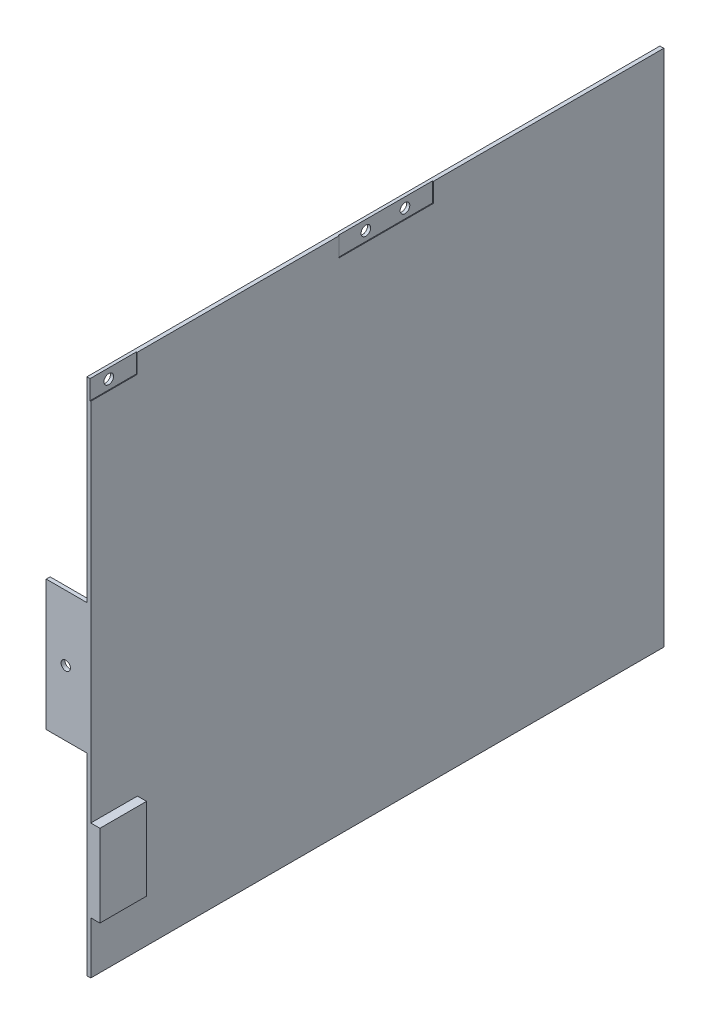
ISO-10303-21;
HEADER;
FILE_DESCRIPTION(('STEP AP214'),'2;1');
FILE_NAME('part.step','',(''),(''),'','','');
FILE_SCHEMA(('AUTOMOTIVE_DESIGN { 1 0 10303 214 1 1 1 1 }'));
ENDSEC;
DATA;
#1=APPLICATION_CONTEXT('core data for automotive mechanical design processes');
#2=APPLICATION_PROTOCOL_DEFINITION('international standard','automotive_design',2000,#1);
#3=PRODUCT_CONTEXT('',#1,'mechanical');
#4=PRODUCT('Part','Part','',(#3));
#5=PRODUCT_RELATED_PRODUCT_CATEGORY('part','',(#4));
#6=PRODUCT_DEFINITION_FORMATION('','',#4);
#7=PRODUCT_DEFINITION_CONTEXT('part definition',#1,'design');
#8=PRODUCT_DEFINITION('design','',#6,#7);
#9=PRODUCT_DEFINITION_SHAPE('','',#8);
#10=(LENGTH_UNIT() NAMED_UNIT(*) SI_UNIT(.MILLI.,.METRE.));
#11=(NAMED_UNIT(*) PLANE_ANGLE_UNIT() SI_UNIT($,.RADIAN.));
#12=(NAMED_UNIT(*) SI_UNIT($,.STERADIAN.) SOLID_ANGLE_UNIT());
#13=UNCERTAINTY_MEASURE_WITH_UNIT(LENGTH_MEASURE(1.E-05),#10,'distance_accuracy_value','');
#14=(GEOMETRIC_REPRESENTATION_CONTEXT(3) GLOBAL_UNCERTAINTY_ASSIGNED_CONTEXT((#13)) GLOBAL_UNIT_ASSIGNED_CONTEXT((#10,
#11,#12)) REPRESENTATION_CONTEXT('',''));
#15=CARTESIAN_POINT('',(0.,0.,0.));
#16=DIRECTION('',(0.,0.,1.));
#17=DIRECTION('',(1.,0.,0.));
#18=AXIS2_PLACEMENT_3D('',#15,#16,#17);
#19=CARTESIAN_POINT('',(163.5,-79.,-107.55));
#20=DIRECTION('',(0.,0.,1.));
#21=DIRECTION('',(1.,0.,0.));
#22=AXIS2_PLACEMENT_3D('',#19,#20,#21);
#23=PLANE('',#22);
#24=DIRECTION('',(0.,1.,0.));
#25=VECTOR('',#24,1.);
#26=CARTESIAN_POINT('',(162.,-79.,-107.55));
#27=LINE('',#26,#25);
#28=CARTESIAN_POINT('',(162.,-79.,-107.55));
#29=VERTEX_POINT('',#28);
#30=CARTESIAN_POINT('',(162.,-49.,-107.55));
#31=VERTEX_POINT('',#30);
#32=EDGE_CURVE('E234',#29,#31,#27,.T.);
#33=ORIENTED_EDGE('',*,*,#32,.F.);
#34=DIRECTION('',(-1.,0.,0.));
#35=VECTOR('',#34,1.);
#36=CARTESIAN_POINT('',(163.5,-79.,-107.55));
#37=LINE('',#36,#35);
#38=CARTESIAN_POINT('',(160.,-79.,-107.55));
#39=VERTEX_POINT('',#38);
#40=EDGE_CURVE('E50',#29,#39,#37,.T.);
#41=ORIENTED_EDGE('',*,*,#40,.T.);
#42=DIRECTION('',(0.,1.,0.));
#43=VECTOR('',#42,1.);
#44=CARTESIAN_POINT('',(160.,-79.,-107.55));
#45=LINE('',#44,#43);
#46=CARTESIAN_POINT('',(160.,-49.,-107.55));
#47=VERTEX_POINT('',#46);
#48=EDGE_CURVE('E236',#39,#47,#45,.T.);
#49=ORIENTED_EDGE('',*,*,#48,.T.);
#50=DIRECTION('',(-1.,0.,0.));
#51=VECTOR('',#50,1.);
#52=CARTESIAN_POINT('',(163.5,-49.,-107.55));
#53=LINE('',#52,#51);
#54=EDGE_CURVE('E276',#31,#47,#53,.T.);
#55=ORIENTED_EDGE('',*,*,#54,.F.);
#56=EDGE_LOOP('',(#33,#41,#49,#55));
#57=FACE_BOUND('',#56,.T.);
#58=ADVANCED_FACE('F35',(#57),#23,.F.);
#59=CARTESIAN_POINT('',(163.5,-49.,-122.45));
#60=DIRECTION('',(0.,1.,0.));
#61=DIRECTION('',(0.,0.,1.));
#62=AXIS2_PLACEMENT_3D('',#59,#60,#61);
#63=PLANE('',#62);
#64=DIRECTION('',(0.,0.,-1.));
#65=VECTOR('',#64,1.);
#66=CARTESIAN_POINT('',(162.,-49.,-122.45));
#67=LINE('',#66,#65);
#68=CARTESIAN_POINT('',(162.,-49.,-122.45));
#69=VERTEX_POINT('',#68);
#70=EDGE_CURVE('E232',#31,#69,#67,.T.);
#71=ORIENTED_EDGE('',*,*,#70,.F.);
#72=ORIENTED_EDGE('',*,*,#54,.T.);
#73=DIRECTION('',(0.,0.,-1.));
#74=VECTOR('',#73,1.);
#75=CARTESIAN_POINT('',(160.,-49.,-122.45));
#76=LINE('',#75,#74);
#77=CARTESIAN_POINT('',(160.,-49.,-122.45));
#78=VERTEX_POINT('',#77);
#79=EDGE_CURVE('E248',#47,#78,#76,.T.);
#80=ORIENTED_EDGE('',*,*,#79,.T.);
#81=DIRECTION('',(-1.,0.,0.));
#82=VECTOR('',#81,1.);
#83=CARTESIAN_POINT('',(163.5,-49.,-122.45));
#84=LINE('',#83,#82);
#85=EDGE_CURVE('E274',#69,#78,#84,.T.);
#86=ORIENTED_EDGE('',*,*,#85,.F.);
#87=EDGE_LOOP('',(#71,#72,#80,#86));
#88=FACE_BOUND('',#87,.T.);
#89=ADVANCED_FACE('F450',(#88),#63,.F.);
#90=CARTESIAN_POINT('',(163.5,-79.,-122.45));
#91=DIRECTION('',(0.,0.,-1.));
#92=DIRECTION('',(-1.,0.,0.));
#93=AXIS2_PLACEMENT_3D('',#90,#91,#92);
#94=PLANE('',#93);
#95=DIRECTION('',(0.,-1.,0.));
#96=VECTOR('',#95,1.);
#97=CARTESIAN_POINT('',(162.,-79.,-122.45));
#98=LINE('',#97,#96);
#99=CARTESIAN_POINT('',(162.,-79.,-122.45));
#100=VERTEX_POINT('',#99);
#101=EDGE_CURVE('E230',#69,#100,#98,.T.);
#102=ORIENTED_EDGE('',*,*,#101,.F.);
#103=ORIENTED_EDGE('',*,*,#85,.T.);
#104=DIRECTION('',(0.,-1.,0.));
#105=VECTOR('',#104,1.);
#106=CARTESIAN_POINT('',(160.,-79.,-122.45));
#107=LINE('',#106,#105);
#108=CARTESIAN_POINT('',(160.,-79.,-122.45));
#109=VERTEX_POINT('',#108);
#110=EDGE_CURVE('E251',#78,#109,#107,.T.);
#111=ORIENTED_EDGE('',*,*,#110,.T.);
#112=DIRECTION('',(-1.,0.,0.));
#113=VECTOR('',#112,1.);
#114=CARTESIAN_POINT('',(163.5,-79.,-122.45));
#115=LINE('',#114,#113);
#116=EDGE_CURVE('E272',#100,#109,#115,.T.);
#117=ORIENTED_EDGE('',*,*,#116,.F.);
#118=EDGE_LOOP('',(#102,#103,#111,#117));
#119=FACE_BOUND('',#118,.T.);
#120=ADVANCED_FACE('F455',(#119),#94,.F.);
#121=CARTESIAN_POINT('',(160.,100.,-291.));
#122=DIRECTION('',(-1.,0.,0.));
#123=DIRECTION('',(0.,0.,1.));
#124=AXIS2_PLACEMENT_3D('',#121,#122,#123);
#125=PLANE('',#124);
#126=DIRECTION('',(0.,0.,-1.));
#127=VECTOR('',#126,1.);
#128=CARTESIAN_POINT('',(160.,-79.,-107.55));
#129=LINE('',#128,#127);
#130=CARTESIAN_POINT('',(160.,-79.,-106.05));
#131=VERTEX_POINT('',#130);
#132=EDGE_CURVE('E240',#131,#39,#129,.T.);
#133=ORIENTED_EDGE('',*,*,#132,.F.);
#134=DIRECTION('',(0.,-1.,0.));
#135=VECTOR('',#134,1.);
#136=CARTESIAN_POINT('',(160.,100.,-106.05));
#137=LINE('',#136,#135);
#138=CARTESIAN_POINT('',(160.,-99.,-106.05));
#139=VERTEX_POINT('',#138);
#140=EDGE_CURVE('E200',#131,#139,#137,.T.);
#141=ORIENTED_EDGE('',*,*,#140,.T.);
#142=DIRECTION('',(0.,0.,-1.));
#143=VECTOR('',#142,1.);
#144=CARTESIAN_POINT('',(160.,-99.,81.202775637732));
#145=LINE('',#144,#143);
#146=CARTESIAN_POINT('',(160.,-99.,-325.9));
#147=VERTEX_POINT('',#146);
#148=EDGE_CURVE('E194',#139,#147,#145,.T.);
#149=ORIENTED_EDGE('',*,*,#148,.T.);
#150=DIRECTION('',(0.,1.,0.));
#151=VECTOR('',#150,1.);
#152=CARTESIAN_POINT('',(160.,100.,-325.9));
#153=LINE('',#152,#151);
#154=CARTESIAN_POINT('',(160.,100.,-325.9));
#155=VERTEX_POINT('',#154);
#156=EDGE_CURVE('E198',#147,#155,#153,.T.);
#157=ORIENTED_EDGE('',*,*,#156,.T.);
#158=DIRECTION('',(0.,0.,1.));
#159=VECTOR('',#158,1.);
#160=CARTESIAN_POINT('',(160.,100.,-291.));
#161=LINE('',#160,#159);
#162=CARTESIAN_POINT('',(160.,100.,-237.45));
#163=VERTEX_POINT('',#162);
#164=EDGE_CURVE('E361',#155,#163,#161,.T.);
#165=ORIENTED_EDGE('',*,*,#164,.T.);
#166=DIRECTION('',(0.,1.,0.));
#167=VECTOR('',#166,1.);
#168=CARTESIAN_POINT('',(160.,108.85,-237.45));
#169=LINE('',#168,#167);
#170=CARTESIAN_POINT('',(160.,92.65,-237.45));
#171=VERTEX_POINT('',#170);
#172=EDGE_CURVE('E282',#171,#163,#169,.T.);
#173=ORIENTED_EDGE('',*,*,#172,.F.);
#174=DIRECTION('',(0.,0.,-1.));
#175=VECTOR('',#174,1.);
#176=CARTESIAN_POINT('',(160.,92.65,-201.35));
#177=LINE('',#176,#175);
#178=CARTESIAN_POINT('',(160.,92.65,-201.35));
#179=VERTEX_POINT('',#178);
#180=EDGE_CURVE('E290',#179,#171,#177,.T.);
#181=ORIENTED_EDGE('',*,*,#180,.F.);
#182=DIRECTION('',(0.,-1.,0.));
#183=VECTOR('',#182,1.);
#184=CARTESIAN_POINT('',(160.,108.85,-201.35));
#185=LINE('',#184,#183);
#186=CARTESIAN_POINT('',(160.,100.,-201.35));
#187=VERTEX_POINT('',#186);
#188=EDGE_CURVE('E288',#187,#179,#185,.T.);
#189=ORIENTED_EDGE('',*,*,#188,.F.);
#190=CARTESIAN_POINT('',(160.,100.,-123.8));
#191=VERTEX_POINT('',#190);
#192=EDGE_CURVE('E360',#187,#191,#161,.T.);
#193=ORIENTED_EDGE('',*,*,#192,.T.);
#194=DIRECTION('',(0.,1.,0.));
#195=VECTOR('',#194,1.);
#196=CARTESIAN_POINT('',(160.,108.85,-123.8));
#197=LINE('',#196,#195);
#198=CARTESIAN_POINT('',(160.,92.65,-123.8));
#199=VERTEX_POINT('',#198);
#200=EDGE_CURVE('E203',#199,#191,#197,.T.);
#201=ORIENTED_EDGE('',*,*,#200,.F.);
#202=DIRECTION('',(0.,0.,-1.));
#203=VECTOR('',#202,1.);
#204=CARTESIAN_POINT('',(160.,92.65,-123.8));
#205=LINE('',#204,#203);
#206=CARTESIAN_POINT('',(160.,92.65,-106.05));
#207=VERTEX_POINT('',#206);
#208=EDGE_CURVE('E304',#207,#199,#205,.T.);
#209=ORIENTED_EDGE('',*,*,#208,.F.);
#210=CARTESIAN_POINT('',(160.,-47.5,-106.05));
#211=VERTEX_POINT('',#210);
#212=EDGE_CURVE('E351',#207,#211,#137,.T.);
#213=ORIENTED_EDGE('',*,*,#212,.T.);
#214=DIRECTION('',(0.,0.,1.));
#215=VECTOR('',#214,1.);
#216=CARTESIAN_POINT('',(160.,-47.5,-123.95));
#217=LINE('',#216,#215);
#218=CARTESIAN_POINT('',(160.,-47.5,-123.95));
#219=VERTEX_POINT('',#218);
#220=EDGE_CURVE('E260',#219,#211,#217,.T.);
#221=ORIENTED_EDGE('',*,*,#220,.F.);
#222=DIRECTION('',(0.,1.,0.));
#223=VECTOR('',#222,1.);
#224=CARTESIAN_POINT('',(160.,-79.,-123.95));
#225=LINE('',#224,#223);
#226=CARTESIAN_POINT('',(160.,-79.,-123.95));
#227=VERTEX_POINT('',#226);
#228=EDGE_CURVE('E257',#227,#219,#225,.T.);
#229=ORIENTED_EDGE('',*,*,#228,.F.);
#230=DIRECTION('',(0.,0.,-1.));
#231=VECTOR('',#230,1.);
#232=CARTESIAN_POINT('',(160.,-79.,-123.95));
#233=LINE('',#232,#231);
#234=EDGE_CURVE('E254',#109,#227,#233,.T.);
#235=ORIENTED_EDGE('',*,*,#234,.F.);
#236=ORIENTED_EDGE('',*,*,#110,.F.);
#237=ORIENTED_EDGE('',*,*,#79,.F.);
#238=ORIENTED_EDGE('',*,*,#48,.F.);
#239=EDGE_LOOP('',(#133,#141,#149,#157,#165,#173,#181,#189,#193,#201,#209,#213,#221,#229,#235,
#236,#237,#238));
#240=FACE_BOUND('',#239,.T.);
#241=ADVANCED_FACE('F37',(#240),#125,.F.);
#242=CARTESIAN_POINT('',(155.,96.25,-211.9));
#243=DIRECTION('',(1.,0.,0.));
#244=DIRECTION('',(0.,0.,-1.));
#245=AXIS2_PLACEMENT_3D('',#242,#243,#244);
#246=CYLINDRICAL_SURFACE('',#245,1.85);
#247=CARTESIAN_POINT('',(158.5,96.25,-211.9));
#248=DIRECTION('',(1.,0.,0.));
#249=DIRECTION('',(0.,0.,-1.));
#250=AXIS2_PLACEMENT_3D('',#247,#248,#249);
#251=CIRCLE('',#250,1.85);
#252=CARTESIAN_POINT('',(158.5,96.25,-213.75));
#253=VERTEX_POINT('',#252);
#254=EDGE_CURVE('E372',#253,#253,#251,.T.);
#255=ORIENTED_EDGE('',*,*,#254,.F.);
#256=EDGE_LOOP('',(#255));
#257=FACE_BOUND('',#256,.T.);
#258=CARTESIAN_POINT('',(159.7,96.25,-211.9));
#259=DIRECTION('',(1.,0.,0.));
#260=DIRECTION('',(0.,0.,-1.));
#261=AXIS2_PLACEMENT_3D('',#258,#259,#260);
#262=CIRCLE('',#261,1.85);
#263=CARTESIAN_POINT('',(159.7,96.25,-213.75));
#264=VERTEX_POINT('',#263);
#265=EDGE_CURVE('E310',#264,#264,#262,.F.);
#266=ORIENTED_EDGE('',*,*,#265,.F.);
#267=EDGE_LOOP('',(#266));
#268=FACE_BOUND('',#267,.T.);
#269=ADVANCED_FACE('F488',(#257,#268),#246,.F.);
#270=CARTESIAN_POINT('',(155.,96.25,-226.9));
#271=DIRECTION('',(1.,0.,0.));
#272=DIRECTION('',(0.,0.,-1.));
#273=AXIS2_PLACEMENT_3D('',#270,#271,#272);
#274=CYLINDRICAL_SURFACE('',#273,1.85);
#275=CARTESIAN_POINT('',(158.5,96.25,-226.9));
#276=DIRECTION('',(1.,0.,0.));
#277=DIRECTION('',(0.,0.,-1.));
#278=AXIS2_PLACEMENT_3D('',#275,#276,#277);
#279=CIRCLE('',#278,1.85);
#280=CARTESIAN_POINT('',(158.5,96.25,-228.75));
#281=VERTEX_POINT('',#280);
#282=EDGE_CURVE('E336',#281,#281,#279,.T.);
#283=ORIENTED_EDGE('',*,*,#282,.F.);
#284=EDGE_LOOP('',(#283));
#285=FACE_BOUND('',#284,.T.);
#286=CARTESIAN_POINT('',(159.7,96.25,-226.9));
#287=DIRECTION('',(1.,0.,0.));
#288=DIRECTION('',(0.,0.,-1.));
#289=AXIS2_PLACEMENT_3D('',#286,#287,#288);
#290=CIRCLE('',#289,1.85);
#291=CARTESIAN_POINT('',(159.7,96.25,-228.75));
#292=VERTEX_POINT('',#291);
#293=EDGE_CURVE('E297',#292,#292,#290,.F.);
#294=ORIENTED_EDGE('',*,*,#293,.F.);
#295=EDGE_LOOP('',(#294));
#296=FACE_BOUND('',#295,.T.);
#297=ADVANCED_FACE('F485',(#285,#296),#274,.F.);
#298=CARTESIAN_POINT('',(158.5,100.,-291.));
#299=DIRECTION('',(1.,0.,0.));
#300=DIRECTION('',(0.,0.,-1.));
#301=AXIS2_PLACEMENT_3D('',#298,#299,#300);
#302=PLANE('',#301);
#303=ORIENTED_EDGE('',*,*,#282,.T.);
#304=EDGE_LOOP('',(#303));
#305=FACE_BOUND('',#304,.T.);
#306=ORIENTED_EDGE('',*,*,#254,.T.);
#307=EDGE_LOOP('',(#306));
#308=FACE_BOUND('',#307,.T.);
#309=CARTESIAN_POINT('',(158.5,96.25,-113.25));
#310=DIRECTION('',(1.,0.,0.));
#311=DIRECTION('',(0.,0.,-1.));
#312=AXIS2_PLACEMENT_3D('',#309,#310,#311);
#313=CIRCLE('',#312,1.85000000000001);
#314=CARTESIAN_POINT('',(158.5,96.25,-115.1));
#315=VERTEX_POINT('',#314);
#316=EDGE_CURVE('E322',#315,#315,#313,.T.);
#317=ORIENTED_EDGE('',*,*,#316,.T.);
#318=EDGE_LOOP('',(#317));
#319=FACE_BOUND('',#318,.T.);
#320=DIRECTION('',(0.,0.,1.));
#321=VECTOR('',#320,1.);
#322=CARTESIAN_POINT('',(158.5,100.,-291.));
#323=LINE('',#322,#321);
#324=CARTESIAN_POINT('',(158.5,100.,-325.9));
#325=VERTEX_POINT('',#324);
#326=CARTESIAN_POINT('',(158.5,100.,-106.05));
#327=VERTEX_POINT('',#326);
#328=EDGE_CURVE('E363',#325,#327,#323,.T.);
#329=ORIENTED_EDGE('',*,*,#328,.F.);
#330=DIRECTION('',(0.,-1.,0.));
#331=VECTOR('',#330,1.);
#332=CARTESIAN_POINT('',(158.5,100.,-325.9));
#333=LINE('',#332,#331);
#334=CARTESIAN_POINT('',(158.5,-99.,-325.9));
#335=VERTEX_POINT('',#334);
#336=EDGE_CURVE('E225',#325,#335,#333,.T.);
#337=ORIENTED_EDGE('',*,*,#336,.T.);
#338=DIRECTION('',(0.,0.,-1.));
#339=VECTOR('',#338,1.);
#340=CARTESIAN_POINT('',(158.5,-99.,81.202775637732));
#341=LINE('',#340,#339);
#342=CARTESIAN_POINT('',(158.5,-99.,-106.05));
#343=VERTEX_POINT('',#342);
#344=EDGE_CURVE('E204',#343,#335,#341,.T.);
#345=ORIENTED_EDGE('',*,*,#344,.F.);
#346=DIRECTION('',(0.,1.,0.));
#347=VECTOR('',#346,1.);
#348=CARTESIAN_POINT('',(158.5,100.,-106.05));
#349=LINE('',#348,#347);
#350=CARTESIAN_POINT('',(158.5,-25.,-106.05));
#351=VERTEX_POINT('',#350);
#352=EDGE_CURVE('E355',#343,#351,#349,.T.);
#353=ORIENTED_EDGE('',*,*,#352,.T.);
#354=DIRECTION('',(0.,0.,-1.));
#355=VECTOR('',#354,1.);
#356=CARTESIAN_POINT('',(158.5,-25.,-291.));
#357=LINE('',#356,#355);
#358=CARTESIAN_POINT('',(158.5,-25.,-107.55));
#359=VERTEX_POINT('',#358);
#360=EDGE_CURVE('E349',#351,#359,#357,.T.);
#361=ORIENTED_EDGE('',*,*,#360,.T.);
#362=DIRECTION('',(0.,-1.,0.));
#363=VECTOR('',#362,1.);
#364=CARTESIAN_POINT('',(158.5,100.,-107.55));
#365=LINE('',#364,#363);
#366=CARTESIAN_POINT('',(158.5,25.,-107.55));
#367=VERTEX_POINT('',#366);
#368=EDGE_CURVE('E366',#367,#359,#365,.T.);
#369=ORIENTED_EDGE('',*,*,#368,.F.);
#370=DIRECTION('',(0.,0.,1.));
#371=VECTOR('',#370,1.);
#372=CARTESIAN_POINT('',(158.5,25.,-291.));
#373=LINE('',#372,#371);
#374=CARTESIAN_POINT('',(158.5,25.,-106.05));
#375=VERTEX_POINT('',#374);
#376=EDGE_CURVE('E344',#367,#375,#373,.T.);
#377=ORIENTED_EDGE('',*,*,#376,.T.);
#378=EDGE_CURVE('E354',#375,#327,#349,.T.);
#379=ORIENTED_EDGE('',*,*,#378,.T.);
#380=EDGE_LOOP('',(#329,#337,#345,#353,#361,#369,#377,#379));
#381=FACE_BOUND('',#380,.T.);
#382=ADVANCED_FACE('F439',(#305,#308,#319,#381),#302,.F.);
#383=CARTESIAN_POINT('',(160.,100.,-291.));
#384=DIRECTION('',(0.,-1.,0.));
#385=DIRECTION('',(0.,0.,-1.));
#386=AXIS2_PLACEMENT_3D('',#383,#384,#385);
#387=PLANE('',#386);
#388=ORIENTED_EDGE('',*,*,#192,.F.);
#389=DIRECTION('',(-1.,0.,0.));
#390=VECTOR('',#389,1.);
#391=CARTESIAN_POINT('',(160.,100.,-201.35));
#392=LINE('',#391,#390);
#393=CARTESIAN_POINT('',(159.7,100.,-201.35));
#394=VERTEX_POINT('',#393);
#395=EDGE_CURVE('E43',#187,#394,#392,.T.);
#396=ORIENTED_EDGE('',*,*,#395,.T.);
#397=DIRECTION('',(0.,0.,1.));
#398=VECTOR('',#397,1.);
#399=CARTESIAN_POINT('',(159.7,100.,-291.));
#400=LINE('',#399,#398);
#401=CARTESIAN_POINT('',(159.7,100.,-237.45));
#402=VERTEX_POINT('',#401);
#403=EDGE_CURVE('E313',#402,#394,#400,.T.);
#404=ORIENTED_EDGE('',*,*,#403,.F.);
#405=DIRECTION('',(1.,0.,0.));
#406=VECTOR('',#405,1.);
#407=CARTESIAN_POINT('',(160.,100.,-237.45));
#408=LINE('',#407,#406);
#409=EDGE_CURVE('E386',#402,#163,#408,.T.);
#410=ORIENTED_EDGE('',*,*,#409,.T.);
#411=ORIENTED_EDGE('',*,*,#164,.F.);
#412=DIRECTION('',(-1.,0.,0.));
#413=VECTOR('',#412,1.);
#414=CARTESIAN_POINT('',(158.5,100.,-325.9));
#415=LINE('',#414,#413);
#416=EDGE_CURVE('E214',#155,#325,#415,.T.);
#417=ORIENTED_EDGE('',*,*,#416,.T.);
#418=ORIENTED_EDGE('',*,*,#328,.T.);
#419=DIRECTION('',(1.,0.,0.));
#420=VECTOR('',#419,1.);
#421=CARTESIAN_POINT('',(160.,100.,-106.05));
#422=LINE('',#421,#420);
#423=CARTESIAN_POINT('',(159.7,100.,-106.05));
#424=VERTEX_POINT('',#423);
#425=EDGE_CURVE('E357',#327,#424,#422,.T.);
#426=ORIENTED_EDGE('',*,*,#425,.T.);
#427=DIRECTION('',(0.,0.,-1.));
#428=VECTOR('',#427,1.);
#429=CARTESIAN_POINT('',(159.7,100.,-291.));
#430=LINE('',#429,#428);
#431=CARTESIAN_POINT('',(159.7,100.,-123.8));
#432=VERTEX_POINT('',#431);
#433=EDGE_CURVE('E319',#424,#432,#430,.T.);
#434=ORIENTED_EDGE('',*,*,#433,.T.);
#435=DIRECTION('',(1.,0.,0.));
#436=VECTOR('',#435,1.);
#437=CARTESIAN_POINT('',(160.,100.,-123.8));
#438=LINE('',#437,#436);
#439=EDGE_CURVE('E383',#432,#191,#438,.T.);
#440=ORIENTED_EDGE('',*,*,#439,.T.);
#441=EDGE_LOOP('',(#388,#396,#404,#410,#411,#417,#418,#426,#434,#440));
#442=FACE_BOUND('',#441,.T.);
#443=ADVANCED_FACE('F392',(#442),#387,.F.);
#444=CARTESIAN_POINT('',(0.,0.,-106.05));
#445=DIRECTION('',(0.,0.,-1.));
#446=DIRECTION('',(-1.,0.,0.));
#447=AXIS2_PLACEMENT_3D('',#444,#445,#446);
#448=PLANE('',#447);
#449=CARTESIAN_POINT('',(150.4,0.,-106.05));
#450=DIRECTION('',(0.,0.,-1.));
#451=DIRECTION('',(-1.,0.,0.));
#452=AXIS2_PLACEMENT_3D('',#449,#450,#451);
#453=CIRCLE('',#452,1.80000000000001);
#454=CARTESIAN_POINT('',(148.6,0.,-106.05));
#455=VERTEX_POINT('',#454);
#456=EDGE_CURVE('E218',#455,#455,#453,.T.);
#457=ORIENTED_EDGE('',*,*,#456,.T.);
#458=EDGE_LOOP('',(#457));
#459=FACE_BOUND('',#458,.T.);
#460=DIRECTION('',(-1.,0.,0.));
#461=VECTOR('',#460,1.);
#462=CARTESIAN_POINT('',(163.5,-47.5,-106.05));
#463=LINE('',#462,#461);
#464=CARTESIAN_POINT('',(163.5,-47.5,-106.05));
#465=VERTEX_POINT('',#464);
#466=EDGE_CURVE('E267',#465,#211,#463,.T.);
#467=ORIENTED_EDGE('',*,*,#466,.T.);
#468=ORIENTED_EDGE('',*,*,#212,.F.);
#469=DIRECTION('',(-1.,0.,0.));
#470=VECTOR('',#469,1.);
#471=CARTESIAN_POINT('',(0.,92.65,-106.05));
#472=LINE('',#471,#470);
#473=CARTESIAN_POINT('',(159.7,92.65,-106.05));
#474=VERTEX_POINT('',#473);
#475=EDGE_CURVE('E369',#207,#474,#472,.T.);
#476=ORIENTED_EDGE('',*,*,#475,.T.);
#477=DIRECTION('',(0.,1.,0.));
#478=VECTOR('',#477,1.);
#479=CARTESIAN_POINT('',(159.7,0.,-106.05));
#480=LINE('',#479,#478);
#481=EDGE_CURVE('E316',#474,#424,#480,.T.);
#482=ORIENTED_EDGE('',*,*,#481,.T.);
#483=ORIENTED_EDGE('',*,*,#425,.F.);
#484=ORIENTED_EDGE('',*,*,#378,.F.);
#485=DIRECTION('',(-1.,0.,0.));
#486=VECTOR('',#485,1.);
#487=CARTESIAN_POINT('',(157.9,25.,-106.05));
#488=LINE('',#487,#486);
#489=CARTESIAN_POINT('',(142.9,25.,-106.05));
#490=VERTEX_POINT('',#489);
#491=EDGE_CURVE('E333',#375,#490,#488,.T.);
#492=ORIENTED_EDGE('',*,*,#491,.T.);
#493=DIRECTION('',(0.,-1.,0.));
#494=VECTOR('',#493,1.);
#495=CARTESIAN_POINT('',(142.9,25.,-106.05));
#496=LINE('',#495,#494);
#497=CARTESIAN_POINT('',(142.9,-25.,-106.05));
#498=VERTEX_POINT('',#497);
#499=EDGE_CURVE('E335',#490,#498,#496,.T.);
#500=ORIENTED_EDGE('',*,*,#499,.T.);
#501=DIRECTION('',(1.,0.,0.));
#502=VECTOR('',#501,1.);
#503=CARTESIAN_POINT('',(157.9,-25.,-106.05));
#504=LINE('',#503,#502);
#505=EDGE_CURVE('E326',#498,#351,#504,.T.);
#506=ORIENTED_EDGE('',*,*,#505,.T.);
#507=ORIENTED_EDGE('',*,*,#352,.F.);
#508=DIRECTION('',(1.,0.,0.));
#509=VECTOR('',#508,1.);
#510=CARTESIAN_POINT('',(0.,-99.,-106.05));
#511=LINE('',#510,#509);
#512=EDGE_CURVE('E12',#343,#139,#511,.T.);
#513=ORIENTED_EDGE('',*,*,#512,.T.);
#514=ORIENTED_EDGE('',*,*,#140,.F.);
#515=DIRECTION('',(-1.,0.,0.));
#516=VECTOR('',#515,1.);
#517=CARTESIAN_POINT('',(163.5,-79.,-106.05));
#518=LINE('',#517,#516);
#519=CARTESIAN_POINT('',(163.5,-79.,-106.05));
#520=VERTEX_POINT('',#519);
#521=EDGE_CURVE('E265',#520,#131,#518,.T.);
#522=ORIENTED_EDGE('',*,*,#521,.F.);
#523=DIRECTION('',(0.,-1.,0.));
#524=VECTOR('',#523,1.);
#525=CARTESIAN_POINT('',(163.5,-79.,-106.05));
#526=LINE('',#525,#524);
#527=EDGE_CURVE('E244',#465,#520,#526,.T.);
#528=ORIENTED_EDGE('',*,*,#527,.F.);
#529=EDGE_LOOP('',(#467,#468,#476,#482,#483,#484,#492,#500,#506,#507,#513,#514,#522,#528));
#530=FACE_BOUND('',#529,.T.);
#531=ADVANCED_FACE('F423',(#459,#530),#448,.F.);
#532=CARTESIAN_POINT('',(0.,0.,-107.55));
#533=DIRECTION('',(0.,0.,1.));
#534=DIRECTION('',(1.,0.,0.));
#535=AXIS2_PLACEMENT_3D('',#532,#533,#534);
#536=PLANE('',#535);
#537=CARTESIAN_POINT('',(150.4,0.,-107.55));
#538=DIRECTION('',(0.,0.,-1.));
#539=DIRECTION('',(-1.,0.,0.));
#540=AXIS2_PLACEMENT_3D('',#537,#538,#539);
#541=CIRCLE('',#540,1.80000000000001);
#542=CARTESIAN_POINT('',(148.6,0.,-107.55));
#543=VERTEX_POINT('',#542);
#544=EDGE_CURVE('E221',#543,#543,#541,.T.);
#545=ORIENTED_EDGE('',*,*,#544,.F.);
#546=EDGE_LOOP('',(#545));
#547=FACE_BOUND('',#546,.T.);
#548=DIRECTION('',(-1.,0.,0.));
#549=VECTOR('',#548,1.);
#550=CARTESIAN_POINT('',(160.,25.,-107.55));
#551=LINE('',#550,#549);
#552=CARTESIAN_POINT('',(142.9,25.,-107.55));
#553=VERTEX_POINT('',#552);
#554=EDGE_CURVE('E323',#367,#553,#551,.T.);
#555=ORIENTED_EDGE('',*,*,#554,.F.);
#556=ORIENTED_EDGE('',*,*,#368,.T.);
#557=DIRECTION('',(1.,0.,0.));
#558=VECTOR('',#557,1.);
#559=CARTESIAN_POINT('',(157.9,-25.,-107.55));
#560=LINE('',#559,#558);
#561=CARTESIAN_POINT('',(142.9,-25.,-107.55));
#562=VERTEX_POINT('',#561);
#563=EDGE_CURVE('E329',#562,#359,#560,.T.);
#564=ORIENTED_EDGE('',*,*,#563,.F.);
#565=DIRECTION('',(0.,-1.,0.));
#566=VECTOR('',#565,1.);
#567=CARTESIAN_POINT('',(142.9,25.,-107.55));
#568=LINE('',#567,#566);
#569=EDGE_CURVE('E325',#553,#562,#568,.T.);
#570=ORIENTED_EDGE('',*,*,#569,.F.);
#571=EDGE_LOOP('',(#555,#556,#564,#570));
#572=FACE_BOUND('',#571,.T.);
#573=ADVANCED_FACE('F419',(#547,#572),#536,.F.);
#574=CARTESIAN_POINT('',(157.9,-25.,-107.55));
#575=DIRECTION('',(0.,-1.,0.));
#576=DIRECTION('',(1.,0.,0.));
#577=AXIS2_PLACEMENT_3D('',#574,#575,#576);
#578=PLANE('',#577);
#579=ORIENTED_EDGE('',*,*,#360,.F.);
#580=ORIENTED_EDGE('',*,*,#505,.F.);
#581=DIRECTION('',(0.,0.,1.));
#582=VECTOR('',#581,1.);
#583=CARTESIAN_POINT('',(142.9,-25.,-107.55));
#584=LINE('',#583,#582);
#585=EDGE_CURVE('E341',#562,#498,#584,.T.);
#586=ORIENTED_EDGE('',*,*,#585,.F.);
#587=ORIENTED_EDGE('',*,*,#563,.T.);
#588=EDGE_LOOP('',(#579,#580,#586,#587));
#589=FACE_BOUND('',#588,.T.);
#590=ADVANCED_FACE('F422',(#589),#578,.T.);
#591=CARTESIAN_POINT('',(157.9,25.,-107.55));
#592=DIRECTION('',(0.,1.,0.));
#593=DIRECTION('',(-1.,0.,0.));
#594=AXIS2_PLACEMENT_3D('',#591,#592,#593);
#595=PLANE('',#594);
#596=ORIENTED_EDGE('',*,*,#376,.F.);
#597=ORIENTED_EDGE('',*,*,#554,.T.);
#598=DIRECTION('',(0.,0.,1.));
#599=VECTOR('',#598,1.);
#600=CARTESIAN_POINT('',(142.9,25.,-107.55));
#601=LINE('',#600,#599);
#602=EDGE_CURVE('E332',#553,#490,#601,.T.);
#603=ORIENTED_EDGE('',*,*,#602,.T.);
#604=ORIENTED_EDGE('',*,*,#491,.F.);
#605=EDGE_LOOP('',(#596,#597,#603,#604));
#606=FACE_BOUND('',#605,.T.);
#607=ADVANCED_FACE('F431',(#606),#595,.T.);
#608=CARTESIAN_POINT('',(142.9,25.,-107.55));
#609=DIRECTION('',(-1.,0.,0.));
#610=DIRECTION('',(0.,0.,1.));
#611=AXIS2_PLACEMENT_3D('',#608,#609,#610);
#612=PLANE('',#611);
#613=ORIENTED_EDGE('',*,*,#499,.F.);
#614=ORIENTED_EDGE('',*,*,#602,.F.);
#615=ORIENTED_EDGE('',*,*,#569,.T.);
#616=ORIENTED_EDGE('',*,*,#585,.T.);
#617=EDGE_LOOP('',(#613,#614,#615,#616));
#618=FACE_BOUND('',#617,.T.);
#619=ADVANCED_FACE('F435',(#618),#612,.T.);
#620=CARTESIAN_POINT('',(155.,96.25,-113.25));
#621=DIRECTION('',(1.,0.,0.));
#622=DIRECTION('',(0.,0.,-1.));
#623=AXIS2_PLACEMENT_3D('',#620,#621,#622);
#624=CYLINDRICAL_SURFACE('',#623,1.85000000000001);
#625=CARTESIAN_POINT('',(159.7,96.25,-113.25));
#626=DIRECTION('',(-1.,0.,0.));
#627=DIRECTION('',(0.,0.,1.));
#628=AXIS2_PLACEMENT_3D('',#625,#626,#627);
#629=CIRCLE('',#628,1.85000000000001);
#630=CARTESIAN_POINT('',(159.7,96.25,-111.4));
#631=VERTEX_POINT('',#630);
#632=EDGE_CURVE('E315',#631,#631,#629,.F.);
#633=ORIENTED_EDGE('',*,*,#632,.T.);
#634=EDGE_LOOP('',(#633));
#635=FACE_BOUND('',#634,.T.);
#636=ORIENTED_EDGE('',*,*,#316,.F.);
#637=EDGE_LOOP('',(#636));
#638=FACE_BOUND('',#637,.T.);
#639=ADVANCED_FACE('F474',(#635,#638),#624,.F.);
#640=CARTESIAN_POINT('',(159.7,108.85,-201.35));
#641=DIRECTION('',(0.,0.,1.));
#642=DIRECTION('',(1.,0.,0.));
#643=AXIS2_PLACEMENT_3D('',#640,#641,#642);
#644=PLANE('',#643);
#645=ORIENTED_EDGE('',*,*,#188,.T.);
#646=DIRECTION('',(1.,0.,0.));
#647=VECTOR('',#646,1.);
#648=CARTESIAN_POINT('',(159.7,92.65,-201.35));
#649=LINE('',#648,#647);
#650=CARTESIAN_POINT('',(159.7,92.65,-201.35));
#651=VERTEX_POINT('',#650);
#652=EDGE_CURVE('E287',#651,#179,#649,.T.);
#653=ORIENTED_EDGE('',*,*,#652,.F.);
#654=DIRECTION('',(0.,-1.,0.));
#655=VECTOR('',#654,1.);
#656=CARTESIAN_POINT('',(159.7,108.85,-201.35));
#657=LINE('',#656,#655);
#658=EDGE_CURVE('E279',#394,#651,#657,.T.);
#659=ORIENTED_EDGE('',*,*,#658,.F.);
#660=ORIENTED_EDGE('',*,*,#395,.F.);
#661=EDGE_LOOP('',(#645,#653,#659,#660));
#662=FACE_BOUND('',#661,.T.);
#663=ADVANCED_FACE('F397',(#662),#644,.F.);
#664=CARTESIAN_POINT('',(159.7,108.85,-237.45));
#665=DIRECTION('',(0.,0.,-1.));
#666=DIRECTION('',(-1.,0.,0.));
#667=AXIS2_PLACEMENT_3D('',#664,#665,#666);
#668=PLANE('',#667);
#669=DIRECTION('',(0.,1.,0.));
#670=VECTOR('',#669,1.);
#671=CARTESIAN_POINT('',(159.7,108.85,-237.45));
#672=LINE('',#671,#670);
#673=CARTESIAN_POINT('',(159.7,92.65,-237.45));
#674=VERTEX_POINT('',#673);
#675=EDGE_CURVE('E285',#674,#402,#672,.T.);
#676=ORIENTED_EDGE('',*,*,#675,.F.);
#677=DIRECTION('',(1.,0.,0.));
#678=VECTOR('',#677,1.);
#679=CARTESIAN_POINT('',(159.7,92.65,-237.45));
#680=LINE('',#679,#678);
#681=EDGE_CURVE('E295',#674,#171,#680,.T.);
#682=ORIENTED_EDGE('',*,*,#681,.T.);
#683=ORIENTED_EDGE('',*,*,#172,.T.);
#684=ORIENTED_EDGE('',*,*,#409,.F.);
#685=EDGE_LOOP('',(#676,#682,#683,#684));
#686=FACE_BOUND('',#685,.T.);
#687=ADVANCED_FACE('F410',(#686),#668,.F.);
#688=CARTESIAN_POINT('',(159.7,0.,0.));
#689=DIRECTION('',(1.,0.,0.));
#690=DIRECTION('',(0.,0.,-1.));
#691=AXIS2_PLACEMENT_3D('',#688,#689,#690);
#692=PLANE('',#691);
#693=ORIENTED_EDGE('',*,*,#265,.T.);
#694=EDGE_LOOP('',(#693));
#695=FACE_BOUND('',#694,.T.);
#696=ORIENTED_EDGE('',*,*,#293,.T.);
#697=EDGE_LOOP('',(#696));
#698=FACE_BOUND('',#697,.T.);
#699=ORIENTED_EDGE('',*,*,#403,.T.);
#700=ORIENTED_EDGE('',*,*,#658,.T.);
#701=DIRECTION('',(0.,0.,-1.));
#702=VECTOR('',#701,1.);
#703=CARTESIAN_POINT('',(159.7,92.65,-201.35));
#704=LINE('',#703,#702);
#705=EDGE_CURVE('E281',#651,#674,#704,.T.);
#706=ORIENTED_EDGE('',*,*,#705,.T.);
#707=ORIENTED_EDGE('',*,*,#675,.T.);
#708=EDGE_LOOP('',(#699,#700,#706,#707));
#709=FACE_BOUND('',#708,.T.);
#710=ADVANCED_FACE('F407',(#695,#698,#709),#692,.T.);
#711=CARTESIAN_POINT('',(159.7,92.65,-201.35));
#712=DIRECTION('',(0.,-1.,0.));
#713=DIRECTION('',(0.,0.,-1.));
#714=AXIS2_PLACEMENT_3D('',#711,#712,#713);
#715=PLANE('',#714);
#716=ORIENTED_EDGE('',*,*,#180,.T.);
#717=ORIENTED_EDGE('',*,*,#681,.F.);
#718=ORIENTED_EDGE('',*,*,#705,.F.);
#719=ORIENTED_EDGE('',*,*,#652,.T.);
#720=EDGE_LOOP('',(#716,#717,#718,#719));
#721=FACE_BOUND('',#720,.T.);
#722=ADVANCED_FACE('F403',(#721),#715,.F.);
#723=CARTESIAN_POINT('',(159.7,108.85,-123.8));
#724=DIRECTION('',(0.,0.,-1.));
#725=DIRECTION('',(-1.,0.,0.));
#726=AXIS2_PLACEMENT_3D('',#723,#724,#725);
#727=PLANE('',#726);
#728=DIRECTION('',(0.,1.,0.));
#729=VECTOR('',#728,1.);
#730=CARTESIAN_POINT('',(159.7,108.85,-123.8));
#731=LINE('',#730,#729);
#732=CARTESIAN_POINT('',(159.7,92.65,-123.8));
#733=VERTEX_POINT('',#732);
#734=EDGE_CURVE('E300',#733,#432,#731,.T.);
#735=ORIENTED_EDGE('',*,*,#734,.F.);
#736=DIRECTION('',(1.,0.,0.));
#737=VECTOR('',#736,1.);
#738=CARTESIAN_POINT('',(159.7,92.65,-123.8));
#739=LINE('',#738,#737);
#740=EDGE_CURVE('E291',#733,#199,#739,.T.);
#741=ORIENTED_EDGE('',*,*,#740,.T.);
#742=ORIENTED_EDGE('',*,*,#200,.T.);
#743=ORIENTED_EDGE('',*,*,#439,.F.);
#744=EDGE_LOOP('',(#735,#741,#742,#743));
#745=FACE_BOUND('',#744,.T.);
#746=ADVANCED_FACE('F471',(#745),#727,.F.);
#747=CARTESIAN_POINT('',(159.7,92.65,-123.8));
#748=DIRECTION('',(0.,-1.,0.));
#749=DIRECTION('',(0.,0.,-1.));
#750=AXIS2_PLACEMENT_3D('',#747,#748,#749);
#751=PLANE('',#750);
#752=ORIENTED_EDGE('',*,*,#208,.T.);
#753=ORIENTED_EDGE('',*,*,#740,.F.);
#754=DIRECTION('',(0.,0.,-1.));
#755=VECTOR('',#754,1.);
#756=CARTESIAN_POINT('',(159.7,92.65,-123.8));
#757=LINE('',#756,#755);
#758=EDGE_CURVE('E303',#474,#733,#757,.T.);
#759=ORIENTED_EDGE('',*,*,#758,.F.);
#760=ORIENTED_EDGE('',*,*,#475,.F.);
#761=EDGE_LOOP('',(#752,#753,#759,#760));
#762=FACE_BOUND('',#761,.T.);
#763=ADVANCED_FACE('F477',(#762),#751,.F.);
#764=CARTESIAN_POINT('',(159.7,0.,0.));
#765=DIRECTION('',(-1.,0.,0.));
#766=DIRECTION('',(0.,0.,1.));
#767=AXIS2_PLACEMENT_3D('',#764,#765,#766);
#768=PLANE('',#767);
#769=ORIENTED_EDGE('',*,*,#632,.F.);
#770=EDGE_LOOP('',(#769));
#771=FACE_BOUND('',#770,.T.);
#772=ORIENTED_EDGE('',*,*,#481,.F.);
#773=ORIENTED_EDGE('',*,*,#758,.T.);
#774=ORIENTED_EDGE('',*,*,#734,.T.);
#775=ORIENTED_EDGE('',*,*,#433,.F.);
#776=EDGE_LOOP('',(#772,#773,#774,#775));
#777=FACE_BOUND('',#776,.T.);
#778=ADVANCED_FACE('F463',(#771,#777),#768,.F.);
#779=CARTESIAN_POINT('',(160.,-99.,81.202775637732));
#780=DIRECTION('',(0.,1.,0.));
#781=DIRECTION('',(0.,0.,1.));
#782=AXIS2_PLACEMENT_3D('',#779,#780,#781);
#783=PLANE('',#782);
#784=ORIENTED_EDGE('',*,*,#344,.T.);
#785=DIRECTION('',(1.,0.,0.));
#786=VECTOR('',#785,1.);
#787=CARTESIAN_POINT('',(158.5,-99.,-325.9));
#788=LINE('',#787,#786);
#789=EDGE_CURVE('E211',#335,#147,#788,.T.);
#790=ORIENTED_EDGE('',*,*,#789,.T.);
#791=ORIENTED_EDGE('',*,*,#148,.F.);
#792=ORIENTED_EDGE('',*,*,#512,.F.);
#793=EDGE_LOOP('',(#784,#790,#791,#792));
#794=FACE_BOUND('',#793,.T.);
#795=ADVANCED_FACE('F216',(#794),#783,.F.);
#796=CARTESIAN_POINT('',(163.5,-79.,-123.95));
#797=DIRECTION('',(0.,1.,0.));
#798=DIRECTION('',(0.,0.,1.));
#799=AXIS2_PLACEMENT_3D('',#796,#797,#798);
#800=PLANE('',#799);
#801=DIRECTION('',(0.,0.,-1.));
#802=VECTOR('',#801,1.);
#803=CARTESIAN_POINT('',(163.5,-79.,-123.95));
#804=LINE('',#803,#802);
#805=CARTESIAN_POINT('',(163.5,-79.,-123.95));
#806=VERTEX_POINT('',#805);
#807=EDGE_CURVE('E237',#520,#806,#804,.T.);
#808=ORIENTED_EDGE('',*,*,#807,.F.);
#809=ORIENTED_EDGE('',*,*,#521,.T.);
#810=ORIENTED_EDGE('',*,*,#132,.T.);
#811=ORIENTED_EDGE('',*,*,#40,.F.);
#812=DIRECTION('',(0.,0.,-1.));
#813=VECTOR('',#812,1.);
#814=CARTESIAN_POINT('',(162.,-79.,-123.95));
#815=LINE('',#814,#813);
#816=EDGE_CURVE('E227',#29,#100,#815,.T.);
#817=ORIENTED_EDGE('',*,*,#816,.T.);
#818=ORIENTED_EDGE('',*,*,#116,.T.);
#819=ORIENTED_EDGE('',*,*,#234,.T.);
#820=DIRECTION('',(-1.,0.,0.));
#821=VECTOR('',#820,1.);
#822=CARTESIAN_POINT('',(163.5,-79.,-123.95));
#823=LINE('',#822,#821);
#824=EDGE_CURVE('E270',#806,#227,#823,.T.);
#825=ORIENTED_EDGE('',*,*,#824,.F.);
#826=EDGE_LOOP('',(#808,#809,#810,#811,#817,#818,#819,#825));
#827=FACE_BOUND('',#826,.T.);
#828=ADVANCED_FACE('F462',(#827),#800,.F.);
#829=CARTESIAN_POINT('',(163.5,-79.,-123.95));
#830=DIRECTION('',(0.,0.,1.));
#831=DIRECTION('',(1.,0.,0.));
#832=AXIS2_PLACEMENT_3D('',#829,#830,#831);
#833=PLANE('',#832);
#834=ORIENTED_EDGE('',*,*,#824,.T.);
#835=ORIENTED_EDGE('',*,*,#228,.T.);
#836=DIRECTION('',(-1.,0.,0.));
#837=VECTOR('',#836,1.);
#838=CARTESIAN_POINT('',(163.5,-47.5,-123.95));
#839=LINE('',#838,#837);
#840=CARTESIAN_POINT('',(163.5,-47.5,-123.95));
#841=VERTEX_POINT('',#840);
#842=EDGE_CURVE('E58',#841,#219,#839,.T.);
#843=ORIENTED_EDGE('',*,*,#842,.F.);
#844=DIRECTION('',(0.,1.,0.));
#845=VECTOR('',#844,1.);
#846=CARTESIAN_POINT('',(163.5,-79.,-123.95));
#847=LINE('',#846,#845);
#848=EDGE_CURVE('E239',#806,#841,#847,.T.);
#849=ORIENTED_EDGE('',*,*,#848,.F.);
#850=EDGE_LOOP('',(#834,#835,#843,#849));
#851=FACE_BOUND('',#850,.T.);
#852=ADVANCED_FACE('F533',(#851),#833,.F.);
#853=CARTESIAN_POINT('',(163.5,-47.5,-123.95));
#854=DIRECTION('',(0.,-1.,0.));
#855=DIRECTION('',(0.,0.,-1.));
#856=AXIS2_PLACEMENT_3D('',#853,#854,#855);
#857=PLANE('',#856);
#858=ORIENTED_EDGE('',*,*,#842,.T.);
#859=ORIENTED_EDGE('',*,*,#220,.T.);
#860=ORIENTED_EDGE('',*,*,#466,.F.);
#861=DIRECTION('',(0.,0.,1.));
#862=VECTOR('',#861,1.);
#863=CARTESIAN_POINT('',(163.5,-47.5,-123.95));
#864=LINE('',#863,#862);
#865=EDGE_CURVE('E242',#841,#465,#864,.T.);
#866=ORIENTED_EDGE('',*,*,#865,.F.);
#867=EDGE_LOOP('',(#858,#859,#860,#866));
#868=FACE_BOUND('',#867,.T.);
#869=ADVANCED_FACE('F529',(#868),#857,.F.);
#870=CARTESIAN_POINT('',(163.5,0.,0.));
#871=DIRECTION('',(1.,0.,0.));
#872=DIRECTION('',(0.,0.,-1.));
#873=AXIS2_PLACEMENT_3D('',#870,#871,#872);
#874=PLANE('',#873);
#875=ORIENTED_EDGE('',*,*,#527,.T.);
#876=ORIENTED_EDGE('',*,*,#807,.T.);
#877=ORIENTED_EDGE('',*,*,#848,.T.);
#878=ORIENTED_EDGE('',*,*,#865,.T.);
#879=EDGE_LOOP('',(#875,#876,#877,#878));
#880=FACE_BOUND('',#879,.T.);
#881=ADVANCED_FACE('F525',(#880),#874,.T.);
#882=CARTESIAN_POINT('',(162.,0.,0.));
#883=DIRECTION('',(1.,0.,0.));
#884=DIRECTION('',(0.,0.,-1.));
#885=AXIS2_PLACEMENT_3D('',#882,#883,#884);
#886=PLANE('',#885);
#887=ORIENTED_EDGE('',*,*,#816,.F.);
#888=ORIENTED_EDGE('',*,*,#32,.T.);
#889=ORIENTED_EDGE('',*,*,#70,.T.);
#890=ORIENTED_EDGE('',*,*,#101,.T.);
#891=EDGE_LOOP('',(#887,#888,#889,#890));
#892=FACE_BOUND('',#891,.T.);
#893=ADVANCED_FACE('F520',(#892),#886,.F.);
#894=CARTESIAN_POINT('',(-83.,-99.8628386524749,-325.9));
#895=DIRECTION('',(0.,0.,1.));
#896=DIRECTION('',(1.,0.,0.));
#897=AXIS2_PLACEMENT_3D('',#894,#895,#896);
#898=PLANE('',#897);
#899=ORIENTED_EDGE('',*,*,#416,.F.);
#900=ORIENTED_EDGE('',*,*,#156,.F.);
#901=ORIENTED_EDGE('',*,*,#789,.F.);
#902=ORIENTED_EDGE('',*,*,#336,.F.);
#903=EDGE_LOOP('',(#899,#900,#901,#902));
#904=FACE_BOUND('',#903,.T.);
#905=ADVANCED_FACE('F209',(#904),#898,.F.);
#906=CARTESIAN_POINT('',(150.4,0.,-97.55));
#907=DIRECTION('',(0.,0.,-1.));
#908=DIRECTION('',(-1.,0.,0.));
#909=AXIS2_PLACEMENT_3D('',#906,#907,#908);
#910=CYLINDRICAL_SURFACE('',#909,1.80000000000001);
#911=ORIENTED_EDGE('',*,*,#544,.T.);
#912=EDGE_LOOP('',(#911));
#913=FACE_BOUND('',#912,.T.);
#914=ORIENTED_EDGE('',*,*,#456,.F.);
#915=EDGE_LOOP('',(#914));
#916=FACE_BOUND('',#915,.T.);
#917=ADVANCED_FACE('F416',(#913,#916),#910,.F.);
#918=CLOSED_SHELL('',(#58,#89,#120,#241,#269,#297,#382,#443,#531,#573,#590,#607,#619,#639,#663,
#687,#710,#722,#746,#763,#778,#795,#828,#852,#869,#881,#893,#905,#917));
#919=MANIFOLD_SOLID_BREP('B2',#918);
#920=ADVANCED_BREP_SHAPE_REPRESENTATION('',(#18,#919),#14);
#921=SHAPE_DEFINITION_REPRESENTATION(#9,#920);
ENDSEC;
END-ISO-10303-21;
